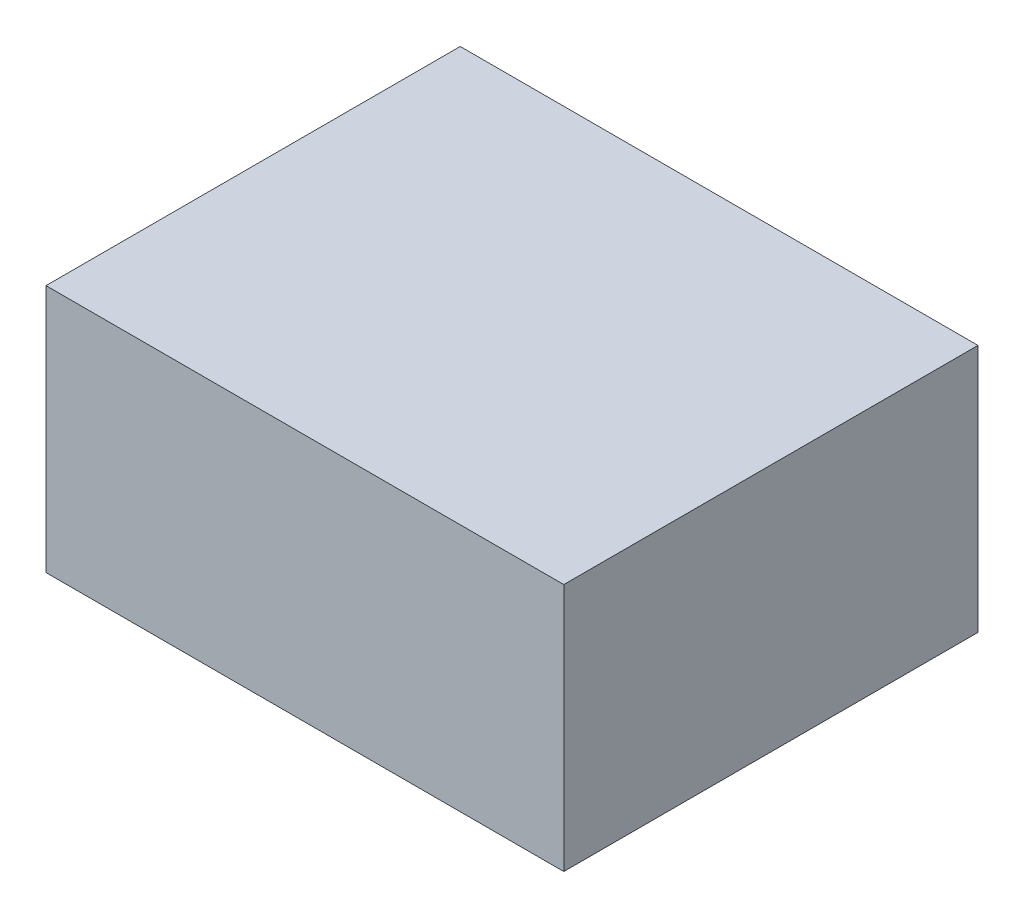
ISO-10303-21;
HEADER;
FILE_DESCRIPTION(('STEP AP214'),'2;1');
FILE_NAME('part.step','',(''),(''),'','','');
FILE_SCHEMA(('AUTOMOTIVE_DESIGN { 1 0 10303 214 1 1 1 1 }'));
ENDSEC;
DATA;
#1=APPLICATION_CONTEXT('core data for automotive mechanical design processes');
#2=APPLICATION_PROTOCOL_DEFINITION('international standard','automotive_design',2000,#1);
#3=PRODUCT_CONTEXT('',#1,'mechanical');
#4=PRODUCT('Part','Part','',(#3));
#5=PRODUCT_RELATED_PRODUCT_CATEGORY('part','',(#4));
#6=PRODUCT_DEFINITION_FORMATION('','',#4);
#7=PRODUCT_DEFINITION_CONTEXT('part definition',#1,'design');
#8=PRODUCT_DEFINITION('design','',#6,#7);
#9=PRODUCT_DEFINITION_SHAPE('','',#8);
#10=(LENGTH_UNIT() NAMED_UNIT(*) SI_UNIT(.MILLI.,.METRE.));
#11=(NAMED_UNIT(*) PLANE_ANGLE_UNIT() SI_UNIT($,.RADIAN.));
#12=(NAMED_UNIT(*) SI_UNIT($,.STERADIAN.) SOLID_ANGLE_UNIT());
#13=UNCERTAINTY_MEASURE_WITH_UNIT(LENGTH_MEASURE(1.E-05),#10,'distance_accuracy_value','');
#14=(GEOMETRIC_REPRESENTATION_CONTEXT(3) GLOBAL_UNCERTAINTY_ASSIGNED_CONTEXT((#13)) GLOBAL_UNIT_ASSIGNED_CONTEXT((#10,
#11,#12)) REPRESENTATION_CONTEXT('',''));
#15=CARTESIAN_POINT('',(0.,0.,0.));
#16=DIRECTION('',(0.,0.,1.));
#17=DIRECTION('',(1.,0.,0.));
#18=AXIS2_PLACEMENT_3D('',#15,#16,#17);
#19=CARTESIAN_POINT('',(-50.,30.,100.));
#20=DIRECTION('',(1.,0.,0.));
#21=DIRECTION('',(0.,1.,0.));
#22=AXIS2_PLACEMENT_3D('',#19,#20,#21);
#23=PLANE('',#22);
#24=DIRECTION('',(0.,-1.,0.));
#25=VECTOR('',#24,1.);
#26=CARTESIAN_POINT('',(-50.,30.,0.));
#27=LINE('',#26,#25);
#28=CARTESIAN_POINT('',(-50.,30.,0.));
#29=VERTEX_POINT('',#28);
#30=CARTESIAN_POINT('',(-50.,-30.,0.));
#31=VERTEX_POINT('',#30);
#32=EDGE_CURVE('E96',#29,#31,#27,.T.);
#33=ORIENTED_EDGE('',*,*,#32,.T.);
#34=DIRECTION('',(0.,0.,-1.));
#35=VECTOR('',#34,1.);
#36=CARTESIAN_POINT('',(-50.,-30.,100.));
#37=LINE('',#36,#35);
#38=CARTESIAN_POINT('',(-50.,-30.,100.));
#39=VERTEX_POINT('',#38);
#40=EDGE_CURVE('E11',#39,#31,#37,.T.);
#41=ORIENTED_EDGE('',*,*,#40,.F.);
#42=DIRECTION('',(0.,-1.,0.));
#43=VECTOR('',#42,1.);
#44=CARTESIAN_POINT('',(-50.,30.,100.));
#45=LINE('',#44,#43);
#46=CARTESIAN_POINT('',(-50.,30.,100.));
#47=VERTEX_POINT('',#46);
#48=EDGE_CURVE('E84',#47,#39,#45,.T.);
#49=ORIENTED_EDGE('',*,*,#48,.F.);
#50=DIRECTION('',(0.,0.,-1.));
#51=VECTOR('',#50,1.);
#52=CARTESIAN_POINT('',(-50.,30.,100.));
#53=LINE('',#52,#51);
#54=EDGE_CURVE('E92',#47,#29,#53,.T.);
#55=ORIENTED_EDGE('',*,*,#54,.T.);
#56=EDGE_LOOP('',(#33,#41,#49,#55));
#57=FACE_BOUND('',#56,.T.);
#58=ADVANCED_FACE('F33',(#57),#23,.F.);
#59=CARTESIAN_POINT('',(-50.,-30.,100.));
#60=DIRECTION('',(0.,1.,0.));
#61=DIRECTION('',(0.,0.,1.));
#62=AXIS2_PLACEMENT_3D('',#59,#60,#61);
#63=PLANE('',#62);
#64=DIRECTION('',(1.,0.,0.));
#65=VECTOR('',#64,1.);
#66=CARTESIAN_POINT('',(-50.,-30.,0.));
#67=LINE('',#66,#65);
#68=CARTESIAN_POINT('',(75.,-30.,0.));
#69=VERTEX_POINT('',#68);
#70=EDGE_CURVE('E88',#31,#69,#67,.T.);
#71=ORIENTED_EDGE('',*,*,#70,.T.);
#72=DIRECTION('',(0.,0.,-1.));
#73=VECTOR('',#72,1.);
#74=CARTESIAN_POINT('',(75.,-30.,100.));
#75=LINE('',#74,#73);
#76=CARTESIAN_POINT('',(75.,-30.,100.));
#77=VERTEX_POINT('',#76);
#78=EDGE_CURVE('E41',#77,#69,#75,.T.);
#79=ORIENTED_EDGE('',*,*,#78,.F.);
#80=DIRECTION('',(1.,0.,0.));
#81=VECTOR('',#80,1.);
#82=CARTESIAN_POINT('',(-50.,-30.,100.));
#83=LINE('',#82,#81);
#84=EDGE_CURVE('E79',#39,#77,#83,.T.);
#85=ORIENTED_EDGE('',*,*,#84,.F.);
#86=ORIENTED_EDGE('',*,*,#40,.T.);
#87=EDGE_LOOP('',(#71,#79,#85,#86));
#88=FACE_BOUND('',#87,.T.);
#89=ADVANCED_FACE('F87',(#88),#63,.F.);
#90=CARTESIAN_POINT('',(75.,30.,100.));
#91=DIRECTION('',(-1.,0.,0.));
#92=DIRECTION('',(0.,-1.,0.));
#93=AXIS2_PLACEMENT_3D('',#90,#91,#92);
#94=PLANE('',#93);
#95=DIRECTION('',(0.,1.,0.));
#96=VECTOR('',#95,1.);
#97=CARTESIAN_POINT('',(75.,30.,0.));
#98=LINE('',#97,#96);
#99=CARTESIAN_POINT('',(75.,30.,0.));
#100=VERTEX_POINT('',#99);
#101=EDGE_CURVE('E66',#69,#100,#98,.T.);
#102=ORIENTED_EDGE('',*,*,#101,.T.);
#103=DIRECTION('',(0.,0.,-1.));
#104=VECTOR('',#103,1.);
#105=CARTESIAN_POINT('',(75.,30.,100.));
#106=LINE('',#105,#104);
#107=CARTESIAN_POINT('',(75.,30.,100.));
#108=VERTEX_POINT('',#107);
#109=EDGE_CURVE('E89',#108,#100,#106,.T.);
#110=ORIENTED_EDGE('',*,*,#109,.F.);
#111=DIRECTION('',(0.,1.,0.));
#112=VECTOR('',#111,1.);
#113=CARTESIAN_POINT('',(75.,30.,100.));
#114=LINE('',#113,#112);
#115=EDGE_CURVE('E82',#77,#108,#114,.T.);
#116=ORIENTED_EDGE('',*,*,#115,.F.);
#117=ORIENTED_EDGE('',*,*,#78,.T.);
#118=EDGE_LOOP('',(#102,#110,#116,#117));
#119=FACE_BOUND('',#118,.T.);
#120=ADVANCED_FACE('F90',(#119),#94,.F.);
#121=CARTESIAN_POINT('',(-50.,30.,100.));
#122=DIRECTION('',(0.,-1.,0.));
#123=DIRECTION('',(0.,0.,-1.));
#124=AXIS2_PLACEMENT_3D('',#121,#122,#123);
#125=PLANE('',#124);
#126=DIRECTION('',(-1.,0.,0.));
#127=VECTOR('',#126,1.);
#128=CARTESIAN_POINT('',(-50.,30.,0.));
#129=LINE('',#128,#127);
#130=EDGE_CURVE('E72',#100,#29,#129,.T.);
#131=ORIENTED_EDGE('',*,*,#130,.T.);
#132=ORIENTED_EDGE('',*,*,#54,.F.);
#133=DIRECTION('',(-1.,0.,0.));
#134=VECTOR('',#133,1.);
#135=CARTESIAN_POINT('',(-50.,30.,100.));
#136=LINE('',#135,#134);
#137=EDGE_CURVE('E49',#108,#47,#136,.T.);
#138=ORIENTED_EDGE('',*,*,#137,.F.);
#139=ORIENTED_EDGE('',*,*,#109,.T.);
#140=EDGE_LOOP('',(#131,#132,#138,#139));
#141=FACE_BOUND('',#140,.T.);
#142=ADVANCED_FACE('F103',(#141),#125,.F.);
#143=CARTESIAN_POINT('',(0.,0.,100.));
#144=DIRECTION('',(0.,0.,1.));
#145=DIRECTION('',(1.,0.,0.));
#146=AXIS2_PLACEMENT_3D('',#143,#144,#145);
#147=PLANE('',#146);
#148=ORIENTED_EDGE('',*,*,#48,.T.);
#149=ORIENTED_EDGE('',*,*,#84,.T.);
#150=ORIENTED_EDGE('',*,*,#115,.T.);
#151=ORIENTED_EDGE('',*,*,#137,.T.);
#152=EDGE_LOOP('',(#148,#149,#150,#151));
#153=FACE_BOUND('',#152,.T.);
#154=ADVANCED_FACE('F80',(#153),#147,.T.);
#155=CARTESIAN_POINT('',(0.,0.,0.));
#156=DIRECTION('',(0.,0.,1.));
#157=DIRECTION('',(1.,0.,0.));
#158=AXIS2_PLACEMENT_3D('',#155,#156,#157);
#159=PLANE('',#158);
#160=ORIENTED_EDGE('',*,*,#32,.F.);
#161=ORIENTED_EDGE('',*,*,#130,.F.);
#162=ORIENTED_EDGE('',*,*,#101,.F.);
#163=ORIENTED_EDGE('',*,*,#70,.F.);
#164=EDGE_LOOP('',(#160,#161,#162,#163));
#165=FACE_BOUND('',#164,.T.);
#166=ADVANCED_FACE('F106',(#165),#159,.F.);
#167=CLOSED_SHELL('',(#58,#89,#120,#142,#154,#166));
#168=MANIFOLD_SOLID_BREP('B2',#167);
#169=ADVANCED_BREP_SHAPE_REPRESENTATION('',(#18,#168),#14);
#170=SHAPE_DEFINITION_REPRESENTATION(#9,#169);
ENDSEC;
END-ISO-10303-21;
